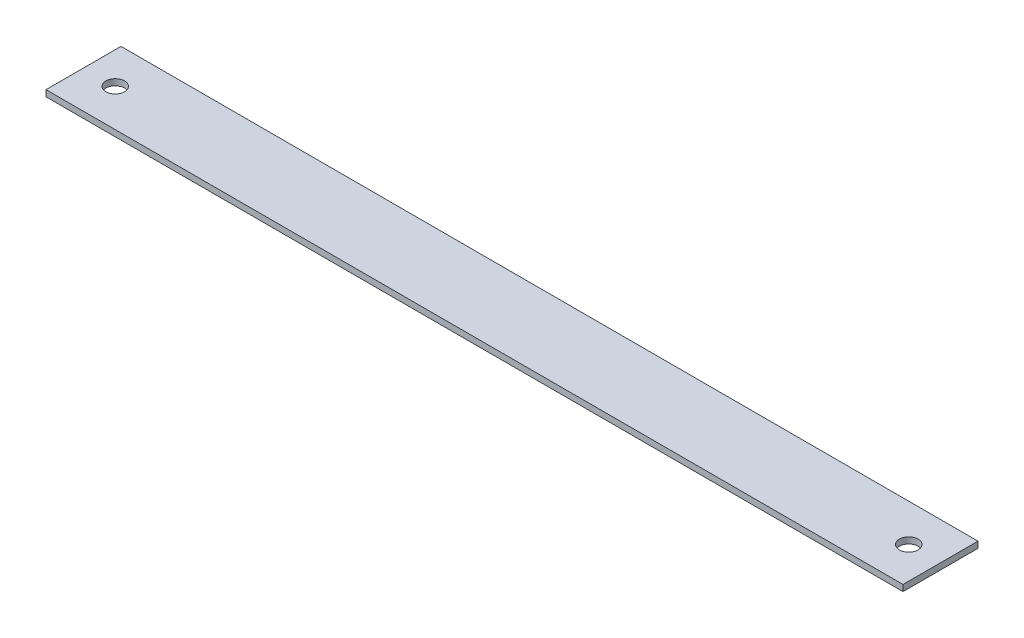
ISO-10303-21;
HEADER;
FILE_DESCRIPTION(('STEP AP214'),'2;1');
FILE_NAME('part.step','',(''),(''),'','','');
FILE_SCHEMA(('AUTOMOTIVE_DESIGN { 1 0 10303 214 1 1 1 1 }'));
ENDSEC;
DATA;
#1=APPLICATION_CONTEXT('core data for automotive mechanical design processes');
#2=APPLICATION_PROTOCOL_DEFINITION('international standard','automotive_design',2000,#1);
#3=PRODUCT_CONTEXT('',#1,'mechanical');
#4=PRODUCT('Part','Part','',(#3));
#5=PRODUCT_RELATED_PRODUCT_CATEGORY('part','',(#4));
#6=PRODUCT_DEFINITION_FORMATION('','',#4);
#7=PRODUCT_DEFINITION_CONTEXT('part definition',#1,'design');
#8=PRODUCT_DEFINITION('design','',#6,#7);
#9=PRODUCT_DEFINITION_SHAPE('','',#8);
#10=(LENGTH_UNIT() NAMED_UNIT(*) SI_UNIT(.MILLI.,.METRE.));
#11=(NAMED_UNIT(*) PLANE_ANGLE_UNIT() SI_UNIT($,.RADIAN.));
#12=(NAMED_UNIT(*) SI_UNIT($,.STERADIAN.) SOLID_ANGLE_UNIT());
#13=UNCERTAINTY_MEASURE_WITH_UNIT(LENGTH_MEASURE(1.E-05),#10,'distance_accuracy_value','');
#14=(GEOMETRIC_REPRESENTATION_CONTEXT(3) GLOBAL_UNCERTAINTY_ASSIGNED_CONTEXT((#13)) GLOBAL_UNIT_ASSIGNED_CONTEXT((#10,
#11,#12)) REPRESENTATION_CONTEXT('',''));
#15=CARTESIAN_POINT('',(0.,0.,0.));
#16=DIRECTION('',(0.,0.,1.));
#17=DIRECTION('',(1.,0.,0.));
#18=AXIS2_PLACEMENT_3D('',#15,#16,#17);
#19=CARTESIAN_POINT('',(0.,5.,0.));
#20=DIRECTION('',(0.,0.,-1.));
#21=DIRECTION('',(-1.,0.,0.));
#22=AXIS2_PLACEMENT_3D('',#19,#20,#21);
#23=PLANE('',#22);
#24=DIRECTION('',(1.,0.,0.));
#25=VECTOR('',#24,1.);
#26=CARTESIAN_POINT('',(0.,0.,0.));
#27=LINE('',#26,#25);
#28=CARTESIAN_POINT('',(0.,0.,0.));
#29=VERTEX_POINT('',#28);
#30=CARTESIAN_POINT('',(685.8,0.,0.));
#31=VERTEX_POINT('',#30);
#32=EDGE_CURVE('E105',#29,#31,#27,.T.);
#33=ORIENTED_EDGE('',*,*,#32,.T.);
#34=DIRECTION('',(0.,-1.,0.));
#35=VECTOR('',#34,1.);
#36=CARTESIAN_POINT('',(685.8,5.,0.));
#37=LINE('',#36,#35);
#38=CARTESIAN_POINT('',(685.8,5.,0.));
#39=VERTEX_POINT('',#38);
#40=EDGE_CURVE('E11',#39,#31,#37,.T.);
#41=ORIENTED_EDGE('',*,*,#40,.F.);
#42=DIRECTION('',(1.,0.,0.));
#43=VECTOR('',#42,1.);
#44=CARTESIAN_POINT('',(0.,5.,0.));
#45=LINE('',#44,#43);
#46=CARTESIAN_POINT('',(0.,5.,0.));
#47=VERTEX_POINT('',#46);
#48=EDGE_CURVE('E85',#47,#39,#45,.T.);
#49=ORIENTED_EDGE('',*,*,#48,.F.);
#50=DIRECTION('',(0.,-1.,0.));
#51=VECTOR('',#50,1.);
#52=CARTESIAN_POINT('',(0.,5.,0.));
#53=LINE('',#52,#51);
#54=EDGE_CURVE('E52',#47,#29,#53,.T.);
#55=ORIENTED_EDGE('',*,*,#54,.T.);
#56=EDGE_LOOP('',(#33,#41,#49,#55));
#57=FACE_BOUND('',#56,.T.);
#58=ADVANCED_FACE('F35',(#57),#23,.F.);
#59=CARTESIAN_POINT('',(685.8,5.,0.));
#60=DIRECTION('',(-1.,0.,0.));
#61=DIRECTION('',(0.,0.,1.));
#62=AXIS2_PLACEMENT_3D('',#59,#60,#61);
#63=PLANE('',#62);
#64=DIRECTION('',(0.,0.,-1.));
#65=VECTOR('',#64,1.);
#66=CARTESIAN_POINT('',(685.8,0.,0.));
#67=LINE('',#66,#65);
#68=CARTESIAN_POINT('',(685.8,0.,-60.));
#69=VERTEX_POINT('',#68);
#70=EDGE_CURVE('E90',#31,#69,#67,.T.);
#71=ORIENTED_EDGE('',*,*,#70,.T.);
#72=DIRECTION('',(0.,-1.,0.));
#73=VECTOR('',#72,1.);
#74=CARTESIAN_POINT('',(685.8,5.,-60.));
#75=LINE('',#74,#73);
#76=CARTESIAN_POINT('',(685.8,5.,-60.));
#77=VERTEX_POINT('',#76);
#78=EDGE_CURVE('E44',#77,#69,#75,.T.);
#79=ORIENTED_EDGE('',*,*,#78,.F.);
#80=DIRECTION('',(0.,0.,-1.));
#81=VECTOR('',#80,1.);
#82=CARTESIAN_POINT('',(685.8,5.,0.));
#83=LINE('',#82,#81);
#84=EDGE_CURVE('E77',#39,#77,#83,.T.);
#85=ORIENTED_EDGE('',*,*,#84,.F.);
#86=ORIENTED_EDGE('',*,*,#40,.T.);
#87=EDGE_LOOP('',(#71,#79,#85,#86));
#88=FACE_BOUND('',#87,.T.);
#89=ADVANCED_FACE('F89',(#88),#63,.F.);
#90=CARTESIAN_POINT('',(0.,5.,-60.));
#91=DIRECTION('',(0.,0.,-1.));
#92=DIRECTION('',(-1.,0.,0.));
#93=AXIS2_PLACEMENT_3D('',#90,#91,#92);
#94=PLANE('',#93);
#95=DIRECTION('',(1.,0.,0.));
#96=VECTOR('',#95,1.);
#97=CARTESIAN_POINT('',(0.,0.,-60.));
#98=LINE('',#97,#96);
#99=CARTESIAN_POINT('',(-1.11022302462516E-13,0.,-60.));
#100=VERTEX_POINT('',#99);
#101=EDGE_CURVE('E108',#100,#69,#98,.T.);
#102=ORIENTED_EDGE('',*,*,#101,.F.);
#103=DIRECTION('',(0.,-1.,0.));
#104=VECTOR('',#103,1.);
#105=CARTESIAN_POINT('',(-1.11022302462516E-13,5.,-60.));
#106=LINE('',#105,#104);
#107=CARTESIAN_POINT('',(-1.11022302462516E-13,5.,-60.));
#108=VERTEX_POINT('',#107);
#109=EDGE_CURVE('E66',#108,#100,#106,.T.);
#110=ORIENTED_EDGE('',*,*,#109,.F.);
#111=DIRECTION('',(1.,0.,0.));
#112=VECTOR('',#111,1.);
#113=CARTESIAN_POINT('',(0.,5.,-60.));
#114=LINE('',#113,#112);
#115=EDGE_CURVE('E84',#108,#77,#114,.T.);
#116=ORIENTED_EDGE('',*,*,#115,.T.);
#117=ORIENTED_EDGE('',*,*,#78,.T.);
#118=EDGE_LOOP('',(#102,#110,#116,#117));
#119=FACE_BOUND('',#118,.T.);
#120=ADVANCED_FACE('F93',(#119),#94,.T.);
#121=CARTESIAN_POINT('',(25.4,5.,-30.));
#122=DIRECTION('',(0.,-1.,0.));
#123=DIRECTION('',(0.,0.,-1.));
#124=AXIS2_PLACEMENT_3D('',#121,#122,#123);
#125=CYLINDRICAL_SURFACE('',#124,7.5);
#126=CARTESIAN_POINT('',(25.4,5.,-30.));
#127=DIRECTION('',(0.,1.,0.));
#128=DIRECTION('',(0.,0.,1.));
#129=AXIS2_PLACEMENT_3D('',#126,#127,#128);
#130=CIRCLE('',#129,7.5);
#131=CARTESIAN_POINT('',(25.4,5.,-22.5));
#132=VERTEX_POINT('',#131);
#133=EDGE_CURVE('E117',#132,#132,#130,.T.);
#134=ORIENTED_EDGE('',*,*,#133,.T.);
#135=EDGE_LOOP('',(#134));
#136=FACE_BOUND('',#135,.T.);
#137=CARTESIAN_POINT('',(25.4,0.,-30.));
#138=DIRECTION('',(0.,1.,0.));
#139=DIRECTION('',(0.,0.,1.));
#140=AXIS2_PLACEMENT_3D('',#137,#138,#139);
#141=CIRCLE('',#140,7.5);
#142=CARTESIAN_POINT('',(25.4,0.,-22.5));
#143=VERTEX_POINT('',#142);
#144=EDGE_CURVE('E102',#143,#143,#141,.T.);
#145=ORIENTED_EDGE('',*,*,#144,.F.);
#146=EDGE_LOOP('',(#145));
#147=FACE_BOUND('',#146,.T.);
#148=ADVANCED_FACE('F125',(#136,#147),#125,.F.);
#149=CARTESIAN_POINT('',(660.4,5.,-30.));
#150=DIRECTION('',(0.,-1.,0.));
#151=DIRECTION('',(0.,0.,-1.));
#152=AXIS2_PLACEMENT_3D('',#149,#150,#151);
#153=CYLINDRICAL_SURFACE('',#152,7.49999999999995);
#154=CARTESIAN_POINT('',(660.4,5.,-30.));
#155=DIRECTION('',(0.,1.,0.));
#156=DIRECTION('',(0.,0.,1.));
#157=AXIS2_PLACEMENT_3D('',#154,#155,#156);
#158=CIRCLE('',#157,7.49999999999995);
#159=CARTESIAN_POINT('',(660.4,5.,-22.5));
#160=VERTEX_POINT('',#159);
#161=EDGE_CURVE('E113',#160,#160,#158,.T.);
#162=ORIENTED_EDGE('',*,*,#161,.T.);
#163=EDGE_LOOP('',(#162));
#164=FACE_BOUND('',#163,.T.);
#165=CARTESIAN_POINT('',(660.4,0.,-30.));
#166=DIRECTION('',(0.,1.,0.));
#167=DIRECTION('',(0.,0.,1.));
#168=AXIS2_PLACEMENT_3D('',#165,#166,#167);
#169=CIRCLE('',#168,7.49999999999995);
#170=CARTESIAN_POINT('',(660.4,0.,-22.5));
#171=VERTEX_POINT('',#170);
#172=EDGE_CURVE('E99',#171,#171,#169,.T.);
#173=ORIENTED_EDGE('',*,*,#172,.F.);
#174=EDGE_LOOP('',(#173));
#175=FACE_BOUND('',#174,.T.);
#176=ADVANCED_FACE('F37',(#164,#175),#153,.F.);
#177=CARTESIAN_POINT('',(0.,5.,0.));
#178=DIRECTION('',(-1.,0.,0.));
#179=DIRECTION('',(0.,0.,1.));
#180=AXIS2_PLACEMENT_3D('',#177,#178,#179);
#181=PLANE('',#180);
#182=DIRECTION('',(0.,0.,-1.));
#183=VECTOR('',#182,1.);
#184=CARTESIAN_POINT('',(0.,0.,0.));
#185=LINE('',#184,#183);
#186=EDGE_CURVE('E110',#29,#100,#185,.T.);
#187=ORIENTED_EDGE('',*,*,#186,.F.);
#188=ORIENTED_EDGE('',*,*,#54,.F.);
#189=DIRECTION('',(0.,0.,-1.));
#190=VECTOR('',#189,1.);
#191=CARTESIAN_POINT('',(0.,5.,0.));
#192=LINE('',#191,#190);
#193=EDGE_CURVE('E94',#47,#108,#192,.T.);
#194=ORIENTED_EDGE('',*,*,#193,.T.);
#195=ORIENTED_EDGE('',*,*,#109,.T.);
#196=EDGE_LOOP('',(#187,#188,#194,#195));
#197=FACE_BOUND('',#196,.T.);
#198=ADVANCED_FACE('F130',(#197),#181,.T.);
#199=CARTESIAN_POINT('',(0.,5.,0.));
#200=DIRECTION('',(0.,1.,0.));
#201=DIRECTION('',(0.,0.,1.));
#202=AXIS2_PLACEMENT_3D('',#199,#200,#201);
#203=PLANE('',#202);
#204=ORIENTED_EDGE('',*,*,#161,.F.);
#205=EDGE_LOOP('',(#204));
#206=FACE_BOUND('',#205,.T.);
#207=ORIENTED_EDGE('',*,*,#133,.F.);
#208=EDGE_LOOP('',(#207));
#209=FACE_BOUND('',#208,.T.);
#210=ORIENTED_EDGE('',*,*,#48,.T.);
#211=ORIENTED_EDGE('',*,*,#84,.T.);
#212=ORIENTED_EDGE('',*,*,#115,.F.);
#213=ORIENTED_EDGE('',*,*,#193,.F.);
#214=EDGE_LOOP('',(#210,#211,#212,#213));
#215=FACE_BOUND('',#214,.T.);
#216=ADVANCED_FACE('F81',(#206,#209,#215),#203,.T.);
#217=CARTESIAN_POINT('',(0.,0.,0.));
#218=DIRECTION('',(0.,1.,0.));
#219=DIRECTION('',(0.,0.,1.));
#220=AXIS2_PLACEMENT_3D('',#217,#218,#219);
#221=PLANE('',#220);
#222=ORIENTED_EDGE('',*,*,#172,.T.);
#223=EDGE_LOOP('',(#222));
#224=FACE_BOUND('',#223,.T.);
#225=ORIENTED_EDGE('',*,*,#144,.T.);
#226=EDGE_LOOP('',(#225));
#227=FACE_BOUND('',#226,.T.);
#228=ORIENTED_EDGE('',*,*,#32,.F.);
#229=ORIENTED_EDGE('',*,*,#186,.T.);
#230=ORIENTED_EDGE('',*,*,#101,.T.);
#231=ORIENTED_EDGE('',*,*,#70,.F.);
#232=EDGE_LOOP('',(#228,#229,#230,#231));
#233=FACE_BOUND('',#232,.T.);
#234=ADVANCED_FACE('F129',(#224,#227,#233),#221,.F.);
#235=CLOSED_SHELL('',(#58,#89,#120,#148,#176,#198,#216,#234));
#236=MANIFOLD_SOLID_BREP('B2',#235);
#237=ADVANCED_BREP_SHAPE_REPRESENTATION('',(#18,#236),#14);
#238=SHAPE_DEFINITION_REPRESENTATION(#9,#237);
ENDSEC;
END-ISO-10303-21;
